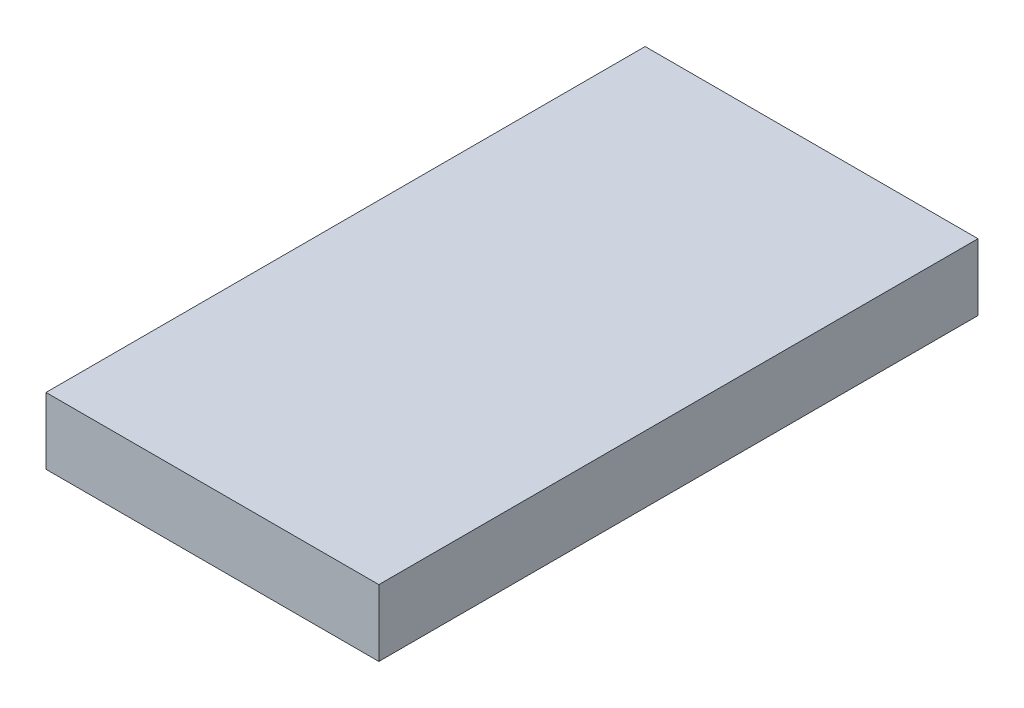
ISO-10303-21;
HEADER;
FILE_DESCRIPTION(('STEP AP214'),'2;1');
FILE_NAME('part.step','',(''),(''),'','','');
FILE_SCHEMA(('AUTOMOTIVE_DESIGN { 1 0 10303 214 1 1 1 1 }'));
ENDSEC;
DATA;
#1=APPLICATION_CONTEXT('core data for automotive mechanical design processes');
#2=APPLICATION_PROTOCOL_DEFINITION('international standard','automotive_design',2000,#1);
#3=PRODUCT_CONTEXT('',#1,'mechanical');
#4=PRODUCT('Part','Part','',(#3));
#5=PRODUCT_RELATED_PRODUCT_CATEGORY('part','',(#4));
#6=PRODUCT_DEFINITION_FORMATION('','',#4);
#7=PRODUCT_DEFINITION_CONTEXT('part definition',#1,'design');
#8=PRODUCT_DEFINITION('design','',#6,#7);
#9=PRODUCT_DEFINITION_SHAPE('','',#8);
#10=(LENGTH_UNIT() NAMED_UNIT(*) SI_UNIT(.MILLI.,.METRE.));
#11=(NAMED_UNIT(*) PLANE_ANGLE_UNIT() SI_UNIT($,.RADIAN.));
#12=(NAMED_UNIT(*) SI_UNIT($,.STERADIAN.) SOLID_ANGLE_UNIT());
#13=UNCERTAINTY_MEASURE_WITH_UNIT(LENGTH_MEASURE(1.E-05),#10,'distance_accuracy_value','');
#14=(GEOMETRIC_REPRESENTATION_CONTEXT(3) GLOBAL_UNCERTAINTY_ASSIGNED_CONTEXT((#13)) GLOBAL_UNIT_ASSIGNED_CONTEXT((#10,
#11,#12)) REPRESENTATION_CONTEXT('',''));
#15=CARTESIAN_POINT('',(0.,0.,0.));
#16=DIRECTION('',(0.,0.,1.));
#17=DIRECTION('',(1.,0.,0.));
#18=AXIS2_PLACEMENT_3D('',#15,#16,#17);
#19=CARTESIAN_POINT('',(0.,12.7,0.));
#20=DIRECTION('',(1.,0.,0.));
#21=DIRECTION('',(0.,0.,-1.));
#22=AXIS2_PLACEMENT_3D('',#19,#20,#21);
#23=PLANE('',#22);
#24=DIRECTION('',(0.,0.,1.));
#25=VECTOR('',#24,1.);
#26=CARTESIAN_POINT('',(0.,0.,0.));
#27=LINE('',#26,#25);
#28=CARTESIAN_POINT('',(0.,0.,-114.3));
#29=VERTEX_POINT('',#28);
#30=CARTESIAN_POINT('',(0.,0.,0.));
#31=VERTEX_POINT('',#30);
#32=EDGE_CURVE('E94',#29,#31,#27,.T.);
#33=ORIENTED_EDGE('',*,*,#32,.T.);
#34=DIRECTION('',(0.,-1.,0.));
#35=VECTOR('',#34,1.);
#36=CARTESIAN_POINT('',(0.,12.7,0.));
#37=LINE('',#36,#35);
#38=CARTESIAN_POINT('',(0.,12.7,0.));
#39=VERTEX_POINT('',#38);
#40=EDGE_CURVE('E11',#39,#31,#37,.T.);
#41=ORIENTED_EDGE('',*,*,#40,.F.);
#42=DIRECTION('',(0.,0.,1.));
#43=VECTOR('',#42,1.);
#44=CARTESIAN_POINT('',(0.,12.7,0.));
#45=LINE('',#44,#43);
#46=CARTESIAN_POINT('',(0.,12.7,-114.3));
#47=VERTEX_POINT('',#46);
#48=EDGE_CURVE('E82',#47,#39,#45,.T.);
#49=ORIENTED_EDGE('',*,*,#48,.F.);
#50=DIRECTION('',(0.,-1.,0.));
#51=VECTOR('',#50,1.);
#52=CARTESIAN_POINT('',(0.,12.7,-114.3));
#53=LINE('',#52,#51);
#54=EDGE_CURVE('E90',#47,#29,#53,.T.);
#55=ORIENTED_EDGE('',*,*,#54,.T.);
#56=EDGE_LOOP('',(#33,#41,#49,#55));
#57=FACE_BOUND('',#56,.T.);
#58=ADVANCED_FACE('F31',(#57),#23,.F.);
#59=CARTESIAN_POINT('',(0.,12.7,0.));
#60=DIRECTION('',(0.,0.,-1.));
#61=DIRECTION('',(-1.,0.,0.));
#62=AXIS2_PLACEMENT_3D('',#59,#60,#61);
#63=PLANE('',#62);
#64=DIRECTION('',(1.,0.,0.));
#65=VECTOR('',#64,1.);
#66=CARTESIAN_POINT('',(0.,0.,0.));
#67=LINE('',#66,#65);
#68=CARTESIAN_POINT('',(63.5,0.,0.));
#69=VERTEX_POINT('',#68);
#70=EDGE_CURVE('E86',#31,#69,#67,.T.);
#71=ORIENTED_EDGE('',*,*,#70,.T.);
#72=DIRECTION('',(0.,-1.,0.));
#73=VECTOR('',#72,1.);
#74=CARTESIAN_POINT('',(63.5,12.7,0.));
#75=LINE('',#74,#73);
#76=CARTESIAN_POINT('',(63.5,12.7,0.));
#77=VERTEX_POINT('',#76);
#78=EDGE_CURVE('E39',#77,#69,#75,.T.);
#79=ORIENTED_EDGE('',*,*,#78,.F.);
#80=DIRECTION('',(1.,0.,0.));
#81=VECTOR('',#80,1.);
#82=CARTESIAN_POINT('',(0.,12.7,0.));
#83=LINE('',#82,#81);
#84=EDGE_CURVE('E77',#39,#77,#83,.T.);
#85=ORIENTED_EDGE('',*,*,#84,.F.);
#86=ORIENTED_EDGE('',*,*,#40,.T.);
#87=EDGE_LOOP('',(#71,#79,#85,#86));
#88=FACE_BOUND('',#87,.T.);
#89=ADVANCED_FACE('F85',(#88),#63,.F.);
#90=CARTESIAN_POINT('',(63.5,12.7,0.));
#91=DIRECTION('',(-1.,0.,0.));
#92=DIRECTION('',(0.,0.,1.));
#93=AXIS2_PLACEMENT_3D('',#90,#91,#92);
#94=PLANE('',#93);
#95=DIRECTION('',(0.,0.,-1.));
#96=VECTOR('',#95,1.);
#97=CARTESIAN_POINT('',(63.5,0.,0.));
#98=LINE('',#97,#96);
#99=CARTESIAN_POINT('',(63.5,0.,-114.3));
#100=VERTEX_POINT('',#99);
#101=EDGE_CURVE('E64',#69,#100,#98,.T.);
#102=ORIENTED_EDGE('',*,*,#101,.T.);
#103=DIRECTION('',(0.,-1.,0.));
#104=VECTOR('',#103,1.);
#105=CARTESIAN_POINT('',(63.5,12.7,-114.3));
#106=LINE('',#105,#104);
#107=CARTESIAN_POINT('',(63.5,12.7,-114.3));
#108=VERTEX_POINT('',#107);
#109=EDGE_CURVE('E87',#108,#100,#106,.T.);
#110=ORIENTED_EDGE('',*,*,#109,.F.);
#111=DIRECTION('',(0.,0.,-1.));
#112=VECTOR('',#111,1.);
#113=CARTESIAN_POINT('',(63.5,12.7,0.));
#114=LINE('',#113,#112);
#115=EDGE_CURVE('E80',#77,#108,#114,.T.);
#116=ORIENTED_EDGE('',*,*,#115,.F.);
#117=ORIENTED_EDGE('',*,*,#78,.T.);
#118=EDGE_LOOP('',(#102,#110,#116,#117));
#119=FACE_BOUND('',#118,.T.);
#120=ADVANCED_FACE('F88',(#119),#94,.F.);
#121=CARTESIAN_POINT('',(0.,12.7,-114.3));
#122=DIRECTION('',(0.,0.,1.));
#123=DIRECTION('',(1.,0.,0.));
#124=AXIS2_PLACEMENT_3D('',#121,#122,#123);
#125=PLANE('',#124);
#126=DIRECTION('',(-1.,0.,0.));
#127=VECTOR('',#126,1.);
#128=CARTESIAN_POINT('',(0.,0.,-114.3));
#129=LINE('',#128,#127);
#130=EDGE_CURVE('E70',#100,#29,#129,.T.);
#131=ORIENTED_EDGE('',*,*,#130,.T.);
#132=ORIENTED_EDGE('',*,*,#54,.F.);
#133=DIRECTION('',(-1.,0.,0.));
#134=VECTOR('',#133,1.);
#135=CARTESIAN_POINT('',(0.,12.7,-114.3));
#136=LINE('',#135,#134);
#137=EDGE_CURVE('E47',#108,#47,#136,.T.);
#138=ORIENTED_EDGE('',*,*,#137,.F.);
#139=ORIENTED_EDGE('',*,*,#109,.T.);
#140=EDGE_LOOP('',(#131,#132,#138,#139));
#141=FACE_BOUND('',#140,.T.);
#142=ADVANCED_FACE('F101',(#141),#125,.F.);
#143=CARTESIAN_POINT('',(0.,12.7,-114.3));
#144=DIRECTION('',(0.,-1.,0.));
#145=DIRECTION('',(0.,0.,-1.));
#146=AXIS2_PLACEMENT_3D('',#143,#144,#145);
#147=PLANE('',#146);
#148=ORIENTED_EDGE('',*,*,#48,.T.);
#149=ORIENTED_EDGE('',*,*,#84,.T.);
#150=ORIENTED_EDGE('',*,*,#115,.T.);
#151=ORIENTED_EDGE('',*,*,#137,.T.);
#152=EDGE_LOOP('',(#148,#149,#150,#151));
#153=FACE_BOUND('',#152,.T.);
#154=ADVANCED_FACE('F78',(#153),#147,.F.);
#155=CARTESIAN_POINT('',(0.,0.,-114.3));
#156=DIRECTION('',(0.,-1.,0.));
#157=DIRECTION('',(0.,0.,-1.));
#158=AXIS2_PLACEMENT_3D('',#155,#156,#157);
#159=PLANE('',#158);
#160=ORIENTED_EDGE('',*,*,#32,.F.);
#161=ORIENTED_EDGE('',*,*,#130,.F.);
#162=ORIENTED_EDGE('',*,*,#101,.F.);
#163=ORIENTED_EDGE('',*,*,#70,.F.);
#164=EDGE_LOOP('',(#160,#161,#162,#163));
#165=FACE_BOUND('',#164,.T.);
#166=ADVANCED_FACE('F104',(#165),#159,.T.);
#167=CLOSED_SHELL('',(#58,#89,#120,#142,#154,#166));
#168=MANIFOLD_SOLID_BREP('B2',#167);
#169=ADVANCED_BREP_SHAPE_REPRESENTATION('',(#18,#168),#14);
#170=SHAPE_DEFINITION_REPRESENTATION(#9,#169);
ENDSEC;
END-ISO-10303-21;
